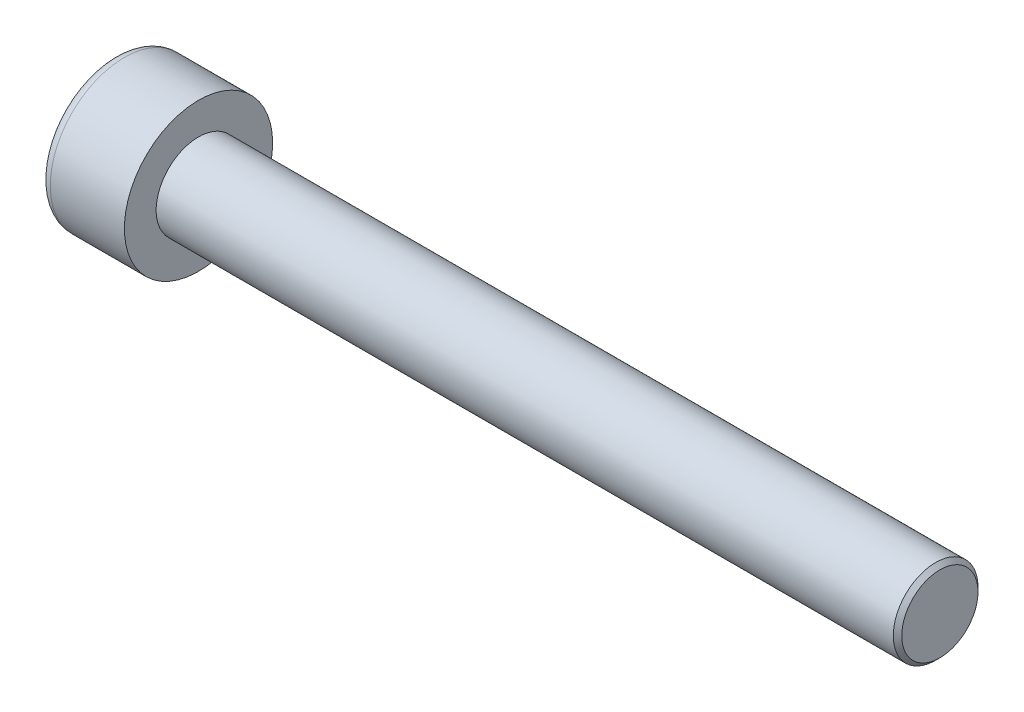
ISO-10303-21;
HEADER;
FILE_DESCRIPTION(('STEP AP214'),'2;1');
FILE_NAME('part.step','',(''),(''),'','','');
FILE_SCHEMA(('AUTOMOTIVE_DESIGN { 1 0 10303 214 1 1 1 1 }'));
ENDSEC;
DATA;
#1=APPLICATION_CONTEXT('core data for automotive mechanical design processes');
#2=APPLICATION_PROTOCOL_DEFINITION('international standard','automotive_design',2000,#1);
#3=PRODUCT_CONTEXT('',#1,'mechanical');
#4=PRODUCT('Part','Part','',(#3));
#5=PRODUCT_RELATED_PRODUCT_CATEGORY('part','',(#4));
#6=PRODUCT_DEFINITION_FORMATION('','',#4);
#7=PRODUCT_DEFINITION_CONTEXT('part definition',#1,'design');
#8=PRODUCT_DEFINITION('design','',#6,#7);
#9=PRODUCT_DEFINITION_SHAPE('','',#8);
#10=(LENGTH_UNIT() NAMED_UNIT(*) SI_UNIT(.MILLI.,.METRE.));
#11=(NAMED_UNIT(*) PLANE_ANGLE_UNIT() SI_UNIT($,.RADIAN.));
#12=(NAMED_UNIT(*) SI_UNIT($,.STERADIAN.) SOLID_ANGLE_UNIT());
#13=UNCERTAINTY_MEASURE_WITH_UNIT(LENGTH_MEASURE(1.E-05),#10,'distance_accuracy_value','');
#14=(GEOMETRIC_REPRESENTATION_CONTEXT(3) GLOBAL_UNCERTAINTY_ASSIGNED_CONTEXT((#13)) GLOBAL_UNIT_ASSIGNED_CONTEXT((#10,
#11,#12)) REPRESENTATION_CONTEXT('',''));
#15=CARTESIAN_POINT('',(0.,0.,0.));
#16=DIRECTION('',(0.,0.,1.));
#17=DIRECTION('',(1.,0.,0.));
#18=AXIS2_PLACEMENT_3D('',#15,#16,#17);
#19=CARTESIAN_POINT('',(2.,0.,-1.73205080756888));
#20=DIRECTION('',(1.,0.,0.));
#21=DIRECTION('',(0.,0.,-1.));
#22=AXIS2_PLACEMENT_3D('',#19,#20,#21);
#23=PLANE('',#22);
#24=CARTESIAN_POINT('',(2.,0.,0.));
#25=DIRECTION('',(1.,0.,0.));
#26=DIRECTION('',(0.,0.,-1.));
#27=AXIS2_PLACEMENT_3D('',#24,#25,#26);
#28=CIRCLE('',#27,1.5);
#29=CARTESIAN_POINT('',(2.,-0.75,-1.29903810567666));
#30=VERTEX_POINT('',#29);
#31=CARTESIAN_POINT('',(2.,-1.5,0.));
#32=VERTEX_POINT('',#31);
#33=EDGE_CURVE('E197',#30,#32,#28,.F.);
#34=ORIENTED_EDGE('',*,*,#33,.F.);
#35=DIRECTION('',(0.,0.866025403784439,-0.5));
#36=VECTOR('',#35,1.);
#37=CARTESIAN_POINT('',(2.,-1.5,-0.866025403784439));
#38=LINE('',#37,#36);
#39=CARTESIAN_POINT('',(2.,-1.5,-0.866025403784439));
#40=VERTEX_POINT('',#39);
#41=EDGE_CURVE('E387',#40,#30,#38,.T.);
#42=ORIENTED_EDGE('',*,*,#41,.F.);
#43=DIRECTION('',(0.,0.,-1.));
#44=VECTOR('',#43,1.);
#45=CARTESIAN_POINT('',(2.,-1.5,0.866025403784439));
#46=LINE('',#45,#44);
#47=EDGE_CURVE('E349',#32,#40,#46,.T.);
#48=ORIENTED_EDGE('',*,*,#47,.F.);
#49=EDGE_LOOP('',(#34,#42,#48));
#50=FACE_BOUND('',#49,.T.);
#51=ADVANCED_FACE('F40',(#50),#23,.F.);
#52=CARTESIAN_POINT('',(2.,-0.75,1.29903810567666));
#53=VERTEX_POINT('',#52);
#54=EDGE_CURVE('E336',#32,#53,#28,.F.);
#55=ORIENTED_EDGE('',*,*,#54,.F.);
#56=CARTESIAN_POINT('',(2.,-1.5,0.866025403784439));
#57=VERTEX_POINT('',#56);
#58=EDGE_CURVE('E342',#57,#32,#46,.T.);
#59=ORIENTED_EDGE('',*,*,#58,.F.);
#60=DIRECTION('',(0.,-0.866025403784438,-0.5));
#61=VECTOR('',#60,1.);
#62=CARTESIAN_POINT('',(2.,0.,1.73205080756888));
#63=LINE('',#62,#61);
#64=EDGE_CURVE('E339',#53,#57,#63,.T.);
#65=ORIENTED_EDGE('',*,*,#64,.F.);
#66=EDGE_LOOP('',(#55,#59,#65));
#67=FACE_BOUND('',#66,.T.);
#68=ADVANCED_FACE('F129',(#67),#23,.F.);
#69=CARTESIAN_POINT('',(2.,0.75,1.29903810567666));
#70=VERTEX_POINT('',#69);
#71=EDGE_CURVE('E329',#53,#70,#28,.F.);
#72=ORIENTED_EDGE('',*,*,#71,.F.);
#73=CARTESIAN_POINT('',(2.,0.,1.73205080756888));
#74=VERTEX_POINT('',#73);
#75=EDGE_CURVE('E332',#74,#53,#63,.T.);
#76=ORIENTED_EDGE('',*,*,#75,.F.);
#77=DIRECTION('',(0.,-0.866025403784438,0.5));
#78=VECTOR('',#77,1.);
#79=CARTESIAN_POINT('',(2.,1.5,0.866025403784439));
#80=LINE('',#79,#78);
#81=EDGE_CURVE('E333',#70,#74,#80,.T.);
#82=ORIENTED_EDGE('',*,*,#81,.F.);
#83=EDGE_LOOP('',(#72,#76,#82));
#84=FACE_BOUND('',#83,.T.);
#85=ADVANCED_FACE('F134',(#84),#23,.F.);
#86=CARTESIAN_POINT('',(2.,1.5,0.));
#87=VERTEX_POINT('',#86);
#88=EDGE_CURVE('E195',#70,#87,#28,.F.);
#89=ORIENTED_EDGE('',*,*,#88,.F.);
#90=CARTESIAN_POINT('',(2.,1.5,0.866025403784439));
#91=VERTEX_POINT('',#90);
#92=EDGE_CURVE('E344',#91,#70,#80,.T.);
#93=ORIENTED_EDGE('',*,*,#92,.F.);
#94=DIRECTION('',(0.,0.,1.));
#95=VECTOR('',#94,1.);
#96=CARTESIAN_POINT('',(2.,1.5,-0.866025403784437));
#97=LINE('',#96,#95);
#98=EDGE_CURVE('E393',#87,#91,#97,.T.);
#99=ORIENTED_EDGE('',*,*,#98,.F.);
#100=EDGE_LOOP('',(#89,#93,#99));
#101=FACE_BOUND('',#100,.T.);
#102=ADVANCED_FACE('F286',(#101),#23,.F.);
#103=CARTESIAN_POINT('',(2.,0.,0.));
#104=DIRECTION('',(1.,0.,0.));
#105=DIRECTION('',(0.,0.,-1.));
#106=AXIS2_PLACEMENT_3D('',#103,#104,#105);
#107=CIRCLE('',#106,1.5);
#108=CARTESIAN_POINT('',(2.,0.750000000000001,-1.29903810567666));
#109=VERTEX_POINT('',#108);
#110=EDGE_CURVE('E55',#109,#87,#107,.T.);
#111=ORIENTED_EDGE('',*,*,#110,.T.);
#112=CARTESIAN_POINT('',(2.,1.5,-0.866025403784437));
#113=VERTEX_POINT('',#112);
#114=EDGE_CURVE('E394',#113,#87,#97,.T.);
#115=ORIENTED_EDGE('',*,*,#114,.F.);
#116=DIRECTION('',(0.,0.866025403784438,0.500000000000001));
#117=VECTOR('',#116,1.);
#118=CARTESIAN_POINT('',(2.,0.,-1.73205080756888));
#119=LINE('',#118,#117);
#120=EDGE_CURVE('E388',#109,#113,#119,.T.);
#121=ORIENTED_EDGE('',*,*,#120,.F.);
#122=EDGE_LOOP('',(#111,#115,#121));
#123=FACE_BOUND('',#122,.T.);
#124=ADVANCED_FACE('F127',(#123),#23,.F.);
#125=CARTESIAN_POINT('',(0.,0.,0.));
#126=DIRECTION('',(1.,0.,0.));
#127=DIRECTION('',(0.,0.,-1.));
#128=AXIS2_PLACEMENT_3D('',#125,#126,#127);
#129=PLANE('',#128);
#130=CARTESIAN_POINT('',(0.,0.,0.));
#131=DIRECTION('',(1.,0.,0.));
#132=DIRECTION('',(0.,0.,-1.));
#133=AXIS2_PLACEMENT_3D('',#130,#131,#132);
#134=CIRCLE('',#133,3.);
#135=CARTESIAN_POINT('',(0.,0.,-3.));
#136=VERTEX_POINT('',#135);
#137=EDGE_CURVE('E204',#136,#136,#134,.F.);
#138=ORIENTED_EDGE('',*,*,#137,.T.);
#139=EDGE_LOOP('',(#138));
#140=FACE_BOUND('',#139,.T.);
#141=DIRECTION('',(0.,0.866025403784439,-0.5));
#142=VECTOR('',#141,1.);
#143=CARTESIAN_POINT('',(0.,-1.5,-0.866025403784439));
#144=LINE('',#143,#142);
#145=CARTESIAN_POINT('',(0.,-1.5,-0.866025403784439));
#146=VERTEX_POINT('',#145);
#147=CARTESIAN_POINT('',(0.,0.,-1.73205080756888));
#148=VERTEX_POINT('',#147);
#149=EDGE_CURVE('E63',#146,#148,#144,.T.);
#150=ORIENTED_EDGE('',*,*,#149,.T.);
#151=DIRECTION('',(0.,0.866025403784438,0.500000000000001));
#152=VECTOR('',#151,1.);
#153=CARTESIAN_POINT('',(0.,0.,-1.73205080756888));
#154=LINE('',#153,#152);
#155=CARTESIAN_POINT('',(0.,1.5,-0.866025403784437));
#156=VERTEX_POINT('',#155);
#157=EDGE_CURVE('E356',#148,#156,#154,.T.);
#158=ORIENTED_EDGE('',*,*,#157,.T.);
#159=DIRECTION('',(0.,0.,1.));
#160=VECTOR('',#159,1.);
#161=CARTESIAN_POINT('',(0.,1.5,-0.866025403784437));
#162=LINE('',#161,#160);
#163=CARTESIAN_POINT('',(0.,1.5,0.866025403784439));
#164=VERTEX_POINT('',#163);
#165=EDGE_CURVE('E359',#156,#164,#162,.T.);
#166=ORIENTED_EDGE('',*,*,#165,.T.);
#167=DIRECTION('',(0.,-0.866025403784438,0.5));
#168=VECTOR('',#167,1.);
#169=CARTESIAN_POINT('',(0.,1.5,0.866025403784439));
#170=LINE('',#169,#168);
#171=CARTESIAN_POINT('',(0.,0.,1.73205080756888));
#172=VERTEX_POINT('',#171);
#173=EDGE_CURVE('E362',#164,#172,#170,.T.);
#174=ORIENTED_EDGE('',*,*,#173,.T.);
#175=DIRECTION('',(0.,-0.866025403784438,-0.5));
#176=VECTOR('',#175,1.);
#177=CARTESIAN_POINT('',(0.,0.,1.73205080756888));
#178=LINE('',#177,#176);
#179=CARTESIAN_POINT('',(0.,-1.5,0.866025403784439));
#180=VERTEX_POINT('',#179);
#181=EDGE_CURVE('E365',#172,#180,#178,.T.);
#182=ORIENTED_EDGE('',*,*,#181,.T.);
#183=DIRECTION('',(0.,0.,-1.));
#184=VECTOR('',#183,1.);
#185=CARTESIAN_POINT('',(0.,-1.5,0.866025403784439));
#186=LINE('',#185,#184);
#187=EDGE_CURVE('E368',#180,#146,#186,.T.);
#188=ORIENTED_EDGE('',*,*,#187,.T.);
#189=EDGE_LOOP('',(#150,#158,#166,#174,#182,#188));
#190=FACE_BOUND('',#189,.T.);
#191=ADVANCED_FACE('F173',(#140,#190),#129,.F.);
#192=CARTESIAN_POINT('',(4.,0.,0.));
#193=DIRECTION('',(-1.,0.,0.));
#194=DIRECTION('',(0.,0.,1.));
#195=AXIS2_PLACEMENT_3D('',#192,#193,#194);
#196=CYLINDRICAL_SURFACE('',#195,3.5);
#197=CARTESIAN_POINT('',(0.5,0.,0.));
#198=DIRECTION('',(1.,0.,0.));
#199=DIRECTION('',(0.,0.,-1.));
#200=AXIS2_PLACEMENT_3D('',#197,#198,#199);
#201=CIRCLE('',#200,3.5);
#202=CARTESIAN_POINT('',(0.5,0.,-3.5));
#203=VERTEX_POINT('',#202);
#204=EDGE_CURVE('E184',#203,#203,#201,.T.);
#205=ORIENTED_EDGE('',*,*,#204,.T.);
#206=EDGE_LOOP('',(#205));
#207=FACE_BOUND('',#206,.T.);
#208=CARTESIAN_POINT('',(4.,0.,0.));
#209=DIRECTION('',(1.,0.,0.));
#210=DIRECTION('',(0.,0.,-1.));
#211=AXIS2_PLACEMENT_3D('',#208,#209,#210);
#212=CIRCLE('',#211,3.5);
#213=CARTESIAN_POINT('',(4.,0.,-3.5));
#214=VERTEX_POINT('',#213);
#215=EDGE_CURVE('E187',#214,#214,#212,.T.);
#216=ORIENTED_EDGE('',*,*,#215,.F.);
#217=EDGE_LOOP('',(#216));
#218=FACE_BOUND('',#217,.T.);
#219=ADVANCED_FACE('F171',(#207,#218),#196,.T.);
#220=CARTESIAN_POINT('',(4.,0.,0.));
#221=DIRECTION('',(1.,0.,0.));
#222=DIRECTION('',(0.,0.,-1.));
#223=AXIS2_PLACEMENT_3D('',#220,#221,#222);
#224=PLANE('',#223);
#225=CARTESIAN_POINT('',(4.,0.,0.));
#226=DIRECTION('',(1.,0.,0.));
#227=DIRECTION('',(0.,0.,-1.));
#228=AXIS2_PLACEMENT_3D('',#225,#226,#227);
#229=CIRCLE('',#228,2.);
#230=CARTESIAN_POINT('',(4.,0.,-2.));
#231=VERTEX_POINT('',#230);
#232=EDGE_CURVE('E191',#231,#231,#229,.T.);
#233=ORIENTED_EDGE('',*,*,#232,.F.);
#234=EDGE_LOOP('',(#233));
#235=FACE_BOUND('',#234,.T.);
#236=ORIENTED_EDGE('',*,*,#215,.T.);
#237=EDGE_LOOP('',(#236));
#238=FACE_BOUND('',#237,.T.);
#239=ADVANCED_FACE('F167',(#235,#238),#224,.T.);
#240=CARTESIAN_POINT('',(39.,0.,0.));
#241=DIRECTION('',(-1.,0.,0.));
#242=DIRECTION('',(0.,0.,1.));
#243=AXIS2_PLACEMENT_3D('',#240,#241,#242);
#244=CYLINDRICAL_SURFACE('',#243,2.);
#245=CARTESIAN_POINT('',(38.8,0.,0.));
#246=DIRECTION('',(1.,0.,0.));
#247=DIRECTION('',(0.,0.,-1.));
#248=AXIS2_PLACEMENT_3D('',#245,#246,#247);
#249=CIRCLE('',#248,2.);
#250=CARTESIAN_POINT('',(38.8,0.,-2.));
#251=VERTEX_POINT('',#250);
#252=EDGE_CURVE('E11',#251,#251,#249,.F.);
#253=ORIENTED_EDGE('',*,*,#252,.T.);
#254=EDGE_LOOP('',(#253));
#255=FACE_BOUND('',#254,.T.);
#256=ORIENTED_EDGE('',*,*,#232,.T.);
#257=EDGE_LOOP('',(#256));
#258=FACE_BOUND('',#257,.T.);
#259=ADVANCED_FACE('F163',(#255,#258),#244,.T.);
#260=CARTESIAN_POINT('',(39.,0.,0.));
#261=DIRECTION('',(1.,0.,0.));
#262=DIRECTION('',(0.,0.,-1.));
#263=AXIS2_PLACEMENT_3D('',#260,#261,#262);
#264=PLANE('',#263);
#265=CARTESIAN_POINT('',(39.,0.,0.));
#266=DIRECTION('',(1.,0.,0.));
#267=DIRECTION('',(0.,0.,-1.));
#268=AXIS2_PLACEMENT_3D('',#265,#266,#267);
#269=CIRCLE('',#268,1.79999999999999);
#270=CARTESIAN_POINT('',(39.,0.,-1.79999999999999));
#271=VERTEX_POINT('',#270);
#272=EDGE_CURVE('E48',#271,#271,#269,.T.);
#273=ORIENTED_EDGE('',*,*,#272,.T.);
#274=EDGE_LOOP('',(#273));
#275=FACE_BOUND('',#274,.T.);
#276=ADVANCED_FACE('F160',(#275),#264,.T.);
#277=CARTESIAN_POINT('',(2.,-1.5,-0.866025403784439));
#278=DIRECTION('',(0.,0.5,0.866025403784439));
#279=DIRECTION('',(0.,-0.866025403784439,0.5));
#280=AXIS2_PLACEMENT_3D('',#277,#278,#279);
#281=PLANE('',#280);
#282=ORIENTED_EDGE('',*,*,#149,.F.);
#283=DIRECTION('',(-1.,0.,0.));
#284=VECTOR('',#283,1.);
#285=CARTESIAN_POINT('',(2.,-1.5,-0.866025403784439));
#286=LINE('',#285,#284);
#287=EDGE_CURVE('E354',#40,#146,#286,.T.);
#288=ORIENTED_EDGE('',*,*,#287,.F.);
#289=ORIENTED_EDGE('',*,*,#41,.T.);
#290=CARTESIAN_POINT('',(2.,0.,-1.73205080756888));
#291=VERTEX_POINT('',#290);
#292=EDGE_CURVE('E371',#30,#291,#38,.T.);
#293=ORIENTED_EDGE('',*,*,#292,.T.);
#294=DIRECTION('',(-1.,0.,0.));
#295=VECTOR('',#294,1.);
#296=CARTESIAN_POINT('',(2.,0.,-1.73205080756888));
#297=LINE('',#296,#295);
#298=EDGE_CURVE('E199',#291,#148,#297,.T.);
#299=ORIENTED_EDGE('',*,*,#298,.T.);
#300=EDGE_LOOP('',(#282,#288,#289,#293,#299));
#301=FACE_BOUND('',#300,.T.);
#302=ADVANCED_FACE('F156',(#301),#281,.T.);
#303=CARTESIAN_POINT('',(2.,0.,-1.73205080756888));
#304=DIRECTION('',(0.,-0.500000000000001,0.866025403784438));
#305=DIRECTION('',(0.,-0.866025403784438,-0.500000000000001));
#306=AXIS2_PLACEMENT_3D('',#303,#304,#305);
#307=PLANE('',#306);
#308=ORIENTED_EDGE('',*,*,#157,.F.);
#309=ORIENTED_EDGE('',*,*,#298,.F.);
#310=EDGE_CURVE('E390',#291,#109,#119,.T.);
#311=ORIENTED_EDGE('',*,*,#310,.T.);
#312=ORIENTED_EDGE('',*,*,#120,.T.);
#313=DIRECTION('',(-1.,0.,0.));
#314=VECTOR('',#313,1.);
#315=CARTESIAN_POINT('',(2.,1.5,-0.866025403784437));
#316=LINE('',#315,#314);
#317=EDGE_CURVE('E378',#113,#156,#316,.T.);
#318=ORIENTED_EDGE('',*,*,#317,.T.);
#319=EDGE_LOOP('',(#308,#309,#311,#312,#318));
#320=FACE_BOUND('',#319,.T.);
#321=ADVANCED_FACE('F152',(#320),#307,.T.);
#322=CARTESIAN_POINT('',(2.,1.5,-0.866025403784437));
#323=DIRECTION('',(0.,-1.,0.));
#324=DIRECTION('',(0.,0.,-1.));
#325=AXIS2_PLACEMENT_3D('',#322,#323,#324);
#326=PLANE('',#325);
#327=ORIENTED_EDGE('',*,*,#165,.F.);
#328=ORIENTED_EDGE('',*,*,#317,.F.);
#329=ORIENTED_EDGE('',*,*,#114,.T.);
#330=ORIENTED_EDGE('',*,*,#98,.T.);
#331=DIRECTION('',(-1.,0.,0.));
#332=VECTOR('',#331,1.);
#333=CARTESIAN_POINT('',(2.,1.5,0.866025403784439));
#334=LINE('',#333,#332);
#335=EDGE_CURVE('E376',#91,#164,#334,.T.);
#336=ORIENTED_EDGE('',*,*,#335,.T.);
#337=EDGE_LOOP('',(#327,#328,#329,#330,#336));
#338=FACE_BOUND('',#337,.T.);
#339=ADVANCED_FACE('F148',(#338),#326,.T.);
#340=CARTESIAN_POINT('',(2.,1.5,0.866025403784439));
#341=DIRECTION('',(0.,-0.5,-0.866025403784438));
#342=DIRECTION('',(0.,0.866025403784439,-0.5));
#343=AXIS2_PLACEMENT_3D('',#340,#341,#342);
#344=PLANE('',#343);
#345=ORIENTED_EDGE('',*,*,#173,.F.);
#346=ORIENTED_EDGE('',*,*,#335,.F.);
#347=ORIENTED_EDGE('',*,*,#92,.T.);
#348=ORIENTED_EDGE('',*,*,#81,.T.);
#349=DIRECTION('',(-1.,0.,0.));
#350=VECTOR('',#349,1.);
#351=CARTESIAN_POINT('',(2.,0.,1.73205080756888));
#352=LINE('',#351,#350);
#353=EDGE_CURVE('E348',#74,#172,#352,.T.);
#354=ORIENTED_EDGE('',*,*,#353,.T.);
#355=EDGE_LOOP('',(#345,#346,#347,#348,#354));
#356=FACE_BOUND('',#355,.T.);
#357=ADVANCED_FACE('F144',(#356),#344,.T.);
#358=CARTESIAN_POINT('',(2.,0.,1.73205080756888));
#359=DIRECTION('',(0.,0.5,-0.866025403784438));
#360=DIRECTION('',(0.,0.866025403784438,0.5));
#361=AXIS2_PLACEMENT_3D('',#358,#359,#360);
#362=PLANE('',#361);
#363=ORIENTED_EDGE('',*,*,#181,.F.);
#364=ORIENTED_EDGE('',*,*,#353,.F.);
#365=ORIENTED_EDGE('',*,*,#75,.T.);
#366=ORIENTED_EDGE('',*,*,#64,.T.);
#367=DIRECTION('',(-1.,0.,0.));
#368=VECTOR('',#367,1.);
#369=CARTESIAN_POINT('',(2.,-1.5,0.866025403784439));
#370=LINE('',#369,#368);
#371=EDGE_CURVE('E373',#57,#180,#370,.T.);
#372=ORIENTED_EDGE('',*,*,#371,.T.);
#373=EDGE_LOOP('',(#363,#364,#365,#366,#372));
#374=FACE_BOUND('',#373,.T.);
#375=ADVANCED_FACE('F140',(#374),#362,.T.);
#376=CARTESIAN_POINT('',(2.,-1.5,0.866025403784439));
#377=DIRECTION('',(0.,1.,0.));
#378=DIRECTION('',(0.,0.,1.));
#379=AXIS2_PLACEMENT_3D('',#376,#377,#378);
#380=PLANE('',#379);
#381=ORIENTED_EDGE('',*,*,#187,.F.);
#382=ORIENTED_EDGE('',*,*,#371,.F.);
#383=ORIENTED_EDGE('',*,*,#58,.T.);
#384=ORIENTED_EDGE('',*,*,#47,.T.);
#385=ORIENTED_EDGE('',*,*,#287,.T.);
#386=EDGE_LOOP('',(#381,#382,#383,#384,#385));
#387=FACE_BOUND('',#386,.T.);
#388=ADVANCED_FACE('F124',(#387),#380,.T.);
#389=EDGE_CURVE('E190',#109,#30,#28,.F.);
#390=ORIENTED_EDGE('',*,*,#389,.F.);
#391=ORIENTED_EDGE('',*,*,#310,.F.);
#392=ORIENTED_EDGE('',*,*,#292,.F.);
#393=EDGE_LOOP('',(#390,#391,#392));
#394=FACE_BOUND('',#393,.T.);
#395=ADVANCED_FACE('F117',(#394),#23,.F.);
#396=CARTESIAN_POINT('',(2.,0.,0.));
#397=DIRECTION('',(-1.,0.,0.));
#398=DIRECTION('',(0.,0.,1.));
#399=AXIS2_PLACEMENT_3D('',#396,#397,#398);
#400=CONICAL_SURFACE('',#399,1.5,1.04719755119659);
#401=CARTESIAN_POINT('',(2.86602540378445,0.,0.));
#402=VERTEX_POINT('',#401);
#403=VERTEX_LOOP('',#402);
#404=FACE_BOUND('',#403,.T.);
#405=ORIENTED_EDGE('',*,*,#110,.F.);
#406=ORIENTED_EDGE('',*,*,#389,.T.);
#407=ORIENTED_EDGE('',*,*,#33,.T.);
#408=ORIENTED_EDGE('',*,*,#54,.T.);
#409=ORIENTED_EDGE('',*,*,#71,.T.);
#410=ORIENTED_EDGE('',*,*,#88,.T.);
#411=EDGE_LOOP('',(#405,#406,#407,#408,#409,#410));
#412=FACE_BOUND('',#411,.T.);
#413=ADVANCED_FACE('F114',(#404,#412),#400,.F.);
#414=CARTESIAN_POINT('',(0.5,0.,0.));
#415=DIRECTION('',(1.,0.,0.));
#416=DIRECTION('',(0.,0.,-1.));
#417=AXIS2_PLACEMENT_3D('',#414,#415,#416);
#418=TOROIDAL_SURFACE('',#417,3.,0.5);
#419=ORIENTED_EDGE('',*,*,#137,.F.);
#420=EDGE_LOOP('',(#419));
#421=FACE_BOUND('',#420,.T.);
#422=ORIENTED_EDGE('',*,*,#204,.F.);
#423=EDGE_LOOP('',(#422));
#424=FACE_BOUND('',#423,.T.);
#425=ADVANCED_FACE('F116',(#421,#424),#418,.T.);
#426=CARTESIAN_POINT('',(39.,0.,0.));
#427=DIRECTION('',(-1.,0.,0.));
#428=DIRECTION('',(0.,0.,1.));
#429=AXIS2_PLACEMENT_3D('',#426,#427,#428);
#430=CONICAL_SURFACE('',#429,1.79999999999999,0.785398163397453);
#431=ORIENTED_EDGE('',*,*,#252,.F.);
#432=EDGE_LOOP('',(#431));
#433=FACE_BOUND('',#432,.T.);
#434=ORIENTED_EDGE('',*,*,#272,.F.);
#435=EDGE_LOOP('',(#434));
#436=FACE_BOUND('',#435,.T.);
#437=ADVANCED_FACE('F42',(#433,#436),#430,.T.);
#438=CLOSED_SHELL('',(#51,#68,#85,#102,#124,#191,#219,#239,#259,#276,#302,#321,#339,#357,#375,
#388,#395,#413,#425,#437));
#439=MANIFOLD_SOLID_BREP('B2',#438);
#440=ADVANCED_BREP_SHAPE_REPRESENTATION('',(#18,#439),#14);
#441=SHAPE_DEFINITION_REPRESENTATION(#9,#440);
ENDSEC;
END-ISO-10303-21;
